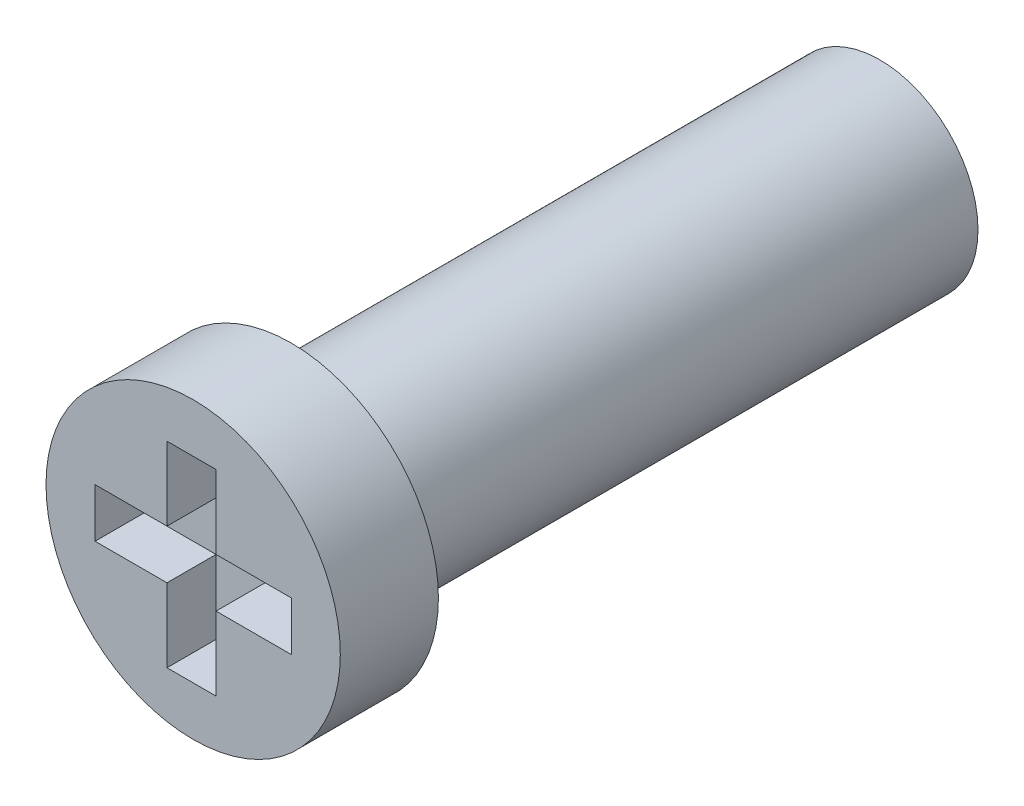
ISO-10303-21;
HEADER;
FILE_DESCRIPTION(('STEP AP214'),'2;1');
FILE_NAME('part.step','',(''),(''),'','','');
FILE_SCHEMA(('AUTOMOTIVE_DESIGN { 1 0 10303 214 1 1 1 1 }'));
ENDSEC;
DATA;
#1=APPLICATION_CONTEXT('core data for automotive mechanical design processes');
#2=APPLICATION_PROTOCOL_DEFINITION('international standard','automotive_design',2000,#1);
#3=PRODUCT_CONTEXT('',#1,'mechanical');
#4=PRODUCT('Part','Part','',(#3));
#5=PRODUCT_RELATED_PRODUCT_CATEGORY('part','',(#4));
#6=PRODUCT_DEFINITION_FORMATION('','',#4);
#7=PRODUCT_DEFINITION_CONTEXT('part definition',#1,'design');
#8=PRODUCT_DEFINITION('design','',#6,#7);
#9=PRODUCT_DEFINITION_SHAPE('','',#8);
#10=(LENGTH_UNIT() NAMED_UNIT(*) SI_UNIT(.MILLI.,.METRE.));
#11=(NAMED_UNIT(*) PLANE_ANGLE_UNIT() SI_UNIT($,.RADIAN.));
#12=(NAMED_UNIT(*) SI_UNIT($,.STERADIAN.) SOLID_ANGLE_UNIT());
#13=UNCERTAINTY_MEASURE_WITH_UNIT(LENGTH_MEASURE(1.E-05),#10,'distance_accuracy_value','');
#14=(GEOMETRIC_REPRESENTATION_CONTEXT(3) GLOBAL_UNCERTAINTY_ASSIGNED_CONTEXT((#13)) GLOBAL_UNIT_ASSIGNED_CONTEXT((#10,
#11,#12)) REPRESENTATION_CONTEXT('',''));
#15=CARTESIAN_POINT('',(0.,0.,0.));
#16=DIRECTION('',(0.,0.,1.));
#17=DIRECTION('',(1.,0.,0.));
#18=AXIS2_PLACEMENT_3D('',#15,#16,#17);
#19=CARTESIAN_POINT('',(0.,0.,12.));
#20=DIRECTION('',(0.,0.,-1.));
#21=DIRECTION('',(-1.,0.,0.));
#22=AXIS2_PLACEMENT_3D('',#19,#20,#21);
#23=CYLINDRICAL_SURFACE('',#22,2.);
#24=CARTESIAN_POINT('',(0.,0.,12.));
#25=DIRECTION('',(0.,0.,1.));
#26=DIRECTION('',(1.,0.,0.));
#27=AXIS2_PLACEMENT_3D('',#24,#25,#26);
#28=CIRCLE('',#27,2.);
#29=CARTESIAN_POINT('',(2.,0.,12.));
#30=VERTEX_POINT('',#29);
#31=EDGE_CURVE('E11',#30,#30,#28,.T.);
#32=ORIENTED_EDGE('',*,*,#31,.F.);
#33=EDGE_LOOP('',(#32));
#34=FACE_BOUND('',#33,.T.);
#35=CARTESIAN_POINT('',(0.,0.,0.));
#36=DIRECTION('',(0.,0.,1.));
#37=DIRECTION('',(1.,0.,0.));
#38=AXIS2_PLACEMENT_3D('',#35,#36,#37);
#39=CIRCLE('',#38,2.);
#40=CARTESIAN_POINT('',(2.,0.,0.));
#41=VERTEX_POINT('',#40);
#42=EDGE_CURVE('E39',#41,#41,#39,.T.);
#43=ORIENTED_EDGE('',*,*,#42,.T.);
#44=EDGE_LOOP('',(#43));
#45=FACE_BOUND('',#44,.T.);
#46=ADVANCED_FACE('F36',(#34,#45),#23,.T.);
#47=CARTESIAN_POINT('',(0.,0.,0.));
#48=DIRECTION('',(0.,0.,1.));
#49=DIRECTION('',(1.,0.,0.));
#50=AXIS2_PLACEMENT_3D('',#47,#48,#49);
#51=PLANE('',#50);
#52=ORIENTED_EDGE('',*,*,#42,.F.);
#53=EDGE_LOOP('',(#52));
#54=FACE_BOUND('',#53,.T.);
#55=ADVANCED_FACE('F233',(#54),#51,.F.);
#56=CARTESIAN_POINT('',(0.,0.,14.));
#57=DIRECTION('',(0.,0.,-1.));
#58=DIRECTION('',(-1.,0.,0.));
#59=AXIS2_PLACEMENT_3D('',#56,#57,#58);
#60=CYLINDRICAL_SURFACE('',#59,3.);
#61=CARTESIAN_POINT('',(0.,0.,14.));
#62=DIRECTION('',(0.,0.,1.));
#63=DIRECTION('',(1.,0.,0.));
#64=AXIS2_PLACEMENT_3D('',#61,#62,#63);
#65=CIRCLE('',#64,3.);
#66=CARTESIAN_POINT('',(3.,0.,14.));
#67=VERTEX_POINT('',#66);
#68=EDGE_CURVE('E209',#67,#67,#65,.T.);
#69=ORIENTED_EDGE('',*,*,#68,.F.);
#70=EDGE_LOOP('',(#69));
#71=FACE_BOUND('',#70,.T.);
#72=CARTESIAN_POINT('',(0.,0.,12.));
#73=DIRECTION('',(0.,0.,1.));
#74=DIRECTION('',(1.,0.,0.));
#75=AXIS2_PLACEMENT_3D('',#72,#73,#74);
#76=CIRCLE('',#75,3.);
#77=CARTESIAN_POINT('',(3.,0.,12.));
#78=VERTEX_POINT('',#77);
#79=EDGE_CURVE('E191',#78,#78,#76,.T.);
#80=ORIENTED_EDGE('',*,*,#79,.T.);
#81=EDGE_LOOP('',(#80));
#82=FACE_BOUND('',#81,.T.);
#83=ADVANCED_FACE('F215',(#71,#82),#60,.T.);
#84=CARTESIAN_POINT('',(0.,0.,14.));
#85=DIRECTION('',(0.,0.,1.));
#86=DIRECTION('',(1.,0.,0.));
#87=AXIS2_PLACEMENT_3D('',#84,#85,#86);
#88=PLANE('',#87);
#89=DIRECTION('',(0.,-1.,0.));
#90=VECTOR('',#89,1.);
#91=CARTESIAN_POINT('',(-0.533471751105531,2.,14.));
#92=LINE('',#91,#90);
#93=CARTESIAN_POINT('',(-0.533471751105531,2.,14.));
#94=VERTEX_POINT('',#93);
#95=CARTESIAN_POINT('',(-0.533471751105531,0.5,14.));
#96=VERTEX_POINT('',#95);
#97=EDGE_CURVE('E50',#94,#96,#92,.T.);
#98=ORIENTED_EDGE('',*,*,#97,.F.);
#99=DIRECTION('',(-1.,0.,0.));
#100=VECTOR('',#99,1.);
#101=CARTESIAN_POINT('',(-0.533471751105531,2.,14.));
#102=LINE('',#101,#100);
#103=CARTESIAN_POINT('',(0.466528248894469,2.,14.));
#104=VERTEX_POINT('',#103);
#105=EDGE_CURVE('E187',#104,#94,#102,.T.);
#106=ORIENTED_EDGE('',*,*,#105,.F.);
#107=DIRECTION('',(0.,1.,0.));
#108=VECTOR('',#107,1.);
#109=CARTESIAN_POINT('',(0.466528248894469,2.,14.));
#110=LINE('',#109,#108);
#111=CARTESIAN_POINT('',(0.466528248894469,0.5,14.));
#112=VERTEX_POINT('',#111);
#113=EDGE_CURVE('E185',#112,#104,#110,.T.);
#114=ORIENTED_EDGE('',*,*,#113,.F.);
#115=DIRECTION('',(-1.,0.,0.));
#116=VECTOR('',#115,1.);
#117=CARTESIAN_POINT('',(0.466528248894469,0.5,14.));
#118=LINE('',#117,#116);
#119=CARTESIAN_POINT('',(2.,0.5,14.));
#120=VERTEX_POINT('',#119);
#121=EDGE_CURVE('E134',#120,#112,#118,.T.);
#122=ORIENTED_EDGE('',*,*,#121,.F.);
#123=DIRECTION('',(0.,1.,0.));
#124=VECTOR('',#123,1.);
#125=CARTESIAN_POINT('',(2.,-0.5,14.));
#126=LINE('',#125,#124);
#127=CARTESIAN_POINT('',(2.,-0.5,14.));
#128=VERTEX_POINT('',#127);
#129=EDGE_CURVE('E181',#128,#120,#126,.T.);
#130=ORIENTED_EDGE('',*,*,#129,.F.);
#131=DIRECTION('',(1.,0.,0.));
#132=VECTOR('',#131,1.);
#133=CARTESIAN_POINT('',(0.466528248894469,-0.5,14.));
#134=LINE('',#133,#132);
#135=CARTESIAN_POINT('',(0.466528248894469,-0.5,14.));
#136=VERTEX_POINT('',#135);
#137=EDGE_CURVE('E178',#136,#128,#134,.T.);
#138=ORIENTED_EDGE('',*,*,#137,.F.);
#139=DIRECTION('',(0.,1.,0.));
#140=VECTOR('',#139,1.);
#141=CARTESIAN_POINT('',(0.466528248894469,-0.5,14.));
#142=LINE('',#141,#140);
#143=CARTESIAN_POINT('',(0.466528248894469,-2.,14.));
#144=VERTEX_POINT('',#143);
#145=EDGE_CURVE('E175',#144,#136,#142,.T.);
#146=ORIENTED_EDGE('',*,*,#145,.F.);
#147=DIRECTION('',(1.,0.,0.));
#148=VECTOR('',#147,1.);
#149=CARTESIAN_POINT('',(-0.533471751105531,-2.,14.));
#150=LINE('',#149,#148);
#151=CARTESIAN_POINT('',(-0.533471751105531,-2.,14.));
#152=VERTEX_POINT('',#151);
#153=EDGE_CURVE('E172',#152,#144,#150,.T.);
#154=ORIENTED_EDGE('',*,*,#153,.F.);
#155=DIRECTION('',(0.,-1.,0.));
#156=VECTOR('',#155,1.);
#157=CARTESIAN_POINT('',(-0.533471751105531,-0.5,14.));
#158=LINE('',#157,#156);
#159=CARTESIAN_POINT('',(-0.533471751105531,-0.5,14.));
#160=VERTEX_POINT('',#159);
#161=EDGE_CURVE('E169',#160,#152,#158,.T.);
#162=ORIENTED_EDGE('',*,*,#161,.F.);
#163=DIRECTION('',(1.,0.,0.));
#164=VECTOR('',#163,1.);
#165=CARTESIAN_POINT('',(-2.,-0.5,14.));
#166=LINE('',#165,#164);
#167=CARTESIAN_POINT('',(-2.,-0.5,14.));
#168=VERTEX_POINT('',#167);
#169=EDGE_CURVE('E166',#168,#160,#166,.T.);
#170=ORIENTED_EDGE('',*,*,#169,.F.);
#171=DIRECTION('',(0.,-1.,0.));
#172=VECTOR('',#171,1.);
#173=CARTESIAN_POINT('',(-2.,-0.5,14.));
#174=LINE('',#173,#172);
#175=CARTESIAN_POINT('',(-2.,0.5,14.));
#176=VERTEX_POINT('',#175);
#177=EDGE_CURVE('E163',#176,#168,#174,.T.);
#178=ORIENTED_EDGE('',*,*,#177,.F.);
#179=DIRECTION('',(-1.,0.,0.));
#180=VECTOR('',#179,1.);
#181=CARTESIAN_POINT('',(-2.,0.5,14.));
#182=LINE('',#181,#180);
#183=EDGE_CURVE('E160',#96,#176,#182,.T.);
#184=ORIENTED_EDGE('',*,*,#183,.F.);
#185=EDGE_LOOP('',(#98,#106,#114,#122,#130,#138,#146,#154,#162,#170,#178,#184));
#186=FACE_BOUND('',#185,.T.);
#187=ORIENTED_EDGE('',*,*,#68,.T.);
#188=EDGE_LOOP('',(#187));
#189=FACE_BOUND('',#188,.T.);
#190=ADVANCED_FACE('F220',(#186,#189),#88,.T.);
#191=CARTESIAN_POINT('',(0.,0.,12.));
#192=DIRECTION('',(0.,0.,1.));
#193=DIRECTION('',(1.,0.,0.));
#194=AXIS2_PLACEMENT_3D('',#191,#192,#193);
#195=PLANE('',#194);
#196=ORIENTED_EDGE('',*,*,#31,.T.);
#197=EDGE_LOOP('',(#196));
#198=FACE_BOUND('',#197,.T.);
#199=ORIENTED_EDGE('',*,*,#79,.F.);
#200=EDGE_LOOP('',(#199));
#201=FACE_BOUND('',#200,.T.);
#202=ADVANCED_FACE('F217',(#198,#201),#195,.F.);
#203=CARTESIAN_POINT('',(-0.533471751105531,2.,13.));
#204=DIRECTION('',(-1.,0.,0.));
#205=DIRECTION('',(0.,-1.,0.));
#206=AXIS2_PLACEMENT_3D('',#203,#204,#205);
#207=PLANE('',#206);
#208=ORIENTED_EDGE('',*,*,#97,.T.);
#209=DIRECTION('',(0.,0.,1.));
#210=VECTOR('',#209,1.);
#211=CARTESIAN_POINT('',(-0.533471751105531,0.5,13.));
#212=LINE('',#211,#210);
#213=CARTESIAN_POINT('',(-0.533471751105531,0.5,13.));
#214=VERTEX_POINT('',#213);
#215=EDGE_CURVE('E98',#214,#96,#212,.T.);
#216=ORIENTED_EDGE('',*,*,#215,.F.);
#217=DIRECTION('',(0.,-1.,0.));
#218=VECTOR('',#217,1.);
#219=CARTESIAN_POINT('',(-0.533471751105531,2.,13.));
#220=LINE('',#219,#218);
#221=CARTESIAN_POINT('',(-0.533471751105531,2.,13.));
#222=VERTEX_POINT('',#221);
#223=EDGE_CURVE('E189',#222,#214,#220,.T.);
#224=ORIENTED_EDGE('',*,*,#223,.F.);
#225=DIRECTION('',(0.,0.,1.));
#226=VECTOR('',#225,1.);
#227=CARTESIAN_POINT('',(-0.533471751105531,2.,13.));
#228=LINE('',#227,#226);
#229=EDGE_CURVE('E58',#222,#94,#228,.T.);
#230=ORIENTED_EDGE('',*,*,#229,.T.);
#231=EDGE_LOOP('',(#208,#216,#224,#230));
#232=FACE_BOUND('',#231,.T.);
#233=ADVANCED_FACE('F219',(#232),#207,.F.);
#234=CARTESIAN_POINT('',(-0.533471751105531,2.,13.));
#235=DIRECTION('',(0.,1.,0.));
#236=DIRECTION('',(0.,0.,1.));
#237=AXIS2_PLACEMENT_3D('',#234,#235,#236);
#238=PLANE('',#237);
#239=ORIENTED_EDGE('',*,*,#105,.T.);
#240=ORIENTED_EDGE('',*,*,#229,.F.);
#241=DIRECTION('',(-1.,0.,0.));
#242=VECTOR('',#241,1.);
#243=CARTESIAN_POINT('',(-0.533471751105531,2.,13.));
#244=LINE('',#243,#242);
#245=CARTESIAN_POINT('',(0.466528248894469,2.,13.));
#246=VERTEX_POINT('',#245);
#247=EDGE_CURVE('E146',#246,#222,#244,.T.);
#248=ORIENTED_EDGE('',*,*,#247,.F.);
#249=DIRECTION('',(0.,0.,1.));
#250=VECTOR('',#249,1.);
#251=CARTESIAN_POINT('',(0.466528248894469,2.,13.));
#252=LINE('',#251,#250);
#253=EDGE_CURVE('E138',#246,#104,#252,.T.);
#254=ORIENTED_EDGE('',*,*,#253,.T.);
#255=EDGE_LOOP('',(#239,#240,#248,#254));
#256=FACE_BOUND('',#255,.T.);
#257=ADVANCED_FACE('F227',(#256),#238,.F.);
#258=CARTESIAN_POINT('',(0.466528248894469,2.,13.));
#259=DIRECTION('',(1.,0.,0.));
#260=DIRECTION('',(0.,1.,0.));
#261=AXIS2_PLACEMENT_3D('',#258,#259,#260);
#262=PLANE('',#261);
#263=ORIENTED_EDGE('',*,*,#113,.T.);
#264=ORIENTED_EDGE('',*,*,#253,.F.);
#265=DIRECTION('',(0.,1.,0.));
#266=VECTOR('',#265,1.);
#267=CARTESIAN_POINT('',(0.466528248894469,2.,13.));
#268=LINE('',#267,#266);
#269=CARTESIAN_POINT('',(0.466528248894469,0.5,13.));
#270=VERTEX_POINT('',#269);
#271=EDGE_CURVE('E142',#270,#246,#268,.T.);
#272=ORIENTED_EDGE('',*,*,#271,.F.);
#273=DIRECTION('',(0.,0.,1.));
#274=VECTOR('',#273,1.);
#275=CARTESIAN_POINT('',(0.466528248894469,0.5,13.));
#276=LINE('',#275,#274);
#277=EDGE_CURVE('E127',#270,#112,#276,.T.);
#278=ORIENTED_EDGE('',*,*,#277,.T.);
#279=EDGE_LOOP('',(#263,#264,#272,#278));
#280=FACE_BOUND('',#279,.T.);
#281=ADVANCED_FACE('F143',(#280),#262,.F.);
#282=CARTESIAN_POINT('',(0.466528248894469,0.5,13.));
#283=DIRECTION('',(0.,1.,0.));
#284=DIRECTION('',(-1.,0.,0.));
#285=AXIS2_PLACEMENT_3D('',#282,#283,#284);
#286=PLANE('',#285);
#287=ORIENTED_EDGE('',*,*,#121,.T.);
#288=ORIENTED_EDGE('',*,*,#277,.F.);
#289=DIRECTION('',(-1.,0.,0.));
#290=VECTOR('',#289,1.);
#291=CARTESIAN_POINT('',(0.466528248894469,0.5,13.));
#292=LINE('',#291,#290);
#293=CARTESIAN_POINT('',(2.,0.5,13.));
#294=VERTEX_POINT('',#293);
#295=EDGE_CURVE('E131',#294,#270,#292,.T.);
#296=ORIENTED_EDGE('',*,*,#295,.F.);
#297=DIRECTION('',(0.,0.,1.));
#298=VECTOR('',#297,1.);
#299=CARTESIAN_POINT('',(2.,0.5,13.));
#300=LINE('',#299,#298);
#301=EDGE_CURVE('E139',#294,#120,#300,.T.);
#302=ORIENTED_EDGE('',*,*,#301,.T.);
#303=EDGE_LOOP('',(#287,#288,#296,#302));
#304=FACE_BOUND('',#303,.T.);
#305=ADVANCED_FACE('F129',(#304),#286,.F.);
#306=CARTESIAN_POINT('',(2.,-0.5,13.));
#307=DIRECTION('',(1.,0.,0.));
#308=DIRECTION('',(0.,0.,-1.));
#309=AXIS2_PLACEMENT_3D('',#306,#307,#308);
#310=PLANE('',#309);
#311=ORIENTED_EDGE('',*,*,#129,.T.);
#312=ORIENTED_EDGE('',*,*,#301,.F.);
#313=DIRECTION('',(0.,1.,0.));
#314=VECTOR('',#313,1.);
#315=CARTESIAN_POINT('',(2.,-0.5,13.));
#316=LINE('',#315,#314);
#317=CARTESIAN_POINT('',(2.,-0.5,13.));
#318=VERTEX_POINT('',#317);
#319=EDGE_CURVE('E152',#318,#294,#316,.T.);
#320=ORIENTED_EDGE('',*,*,#319,.F.);
#321=DIRECTION('',(0.,0.,1.));
#322=VECTOR('',#321,1.);
#323=CARTESIAN_POINT('',(2.,-0.5,13.));
#324=LINE('',#323,#322);
#325=EDGE_CURVE('E194',#318,#128,#324,.T.);
#326=ORIENTED_EDGE('',*,*,#325,.T.);
#327=EDGE_LOOP('',(#311,#312,#320,#326));
#328=FACE_BOUND('',#327,.T.);
#329=ADVANCED_FACE('F288',(#328),#310,.F.);
#330=CARTESIAN_POINT('',(0.466528248894469,-0.5,13.));
#331=DIRECTION('',(0.,-1.,0.));
#332=DIRECTION('',(0.,0.,-1.));
#333=AXIS2_PLACEMENT_3D('',#330,#331,#332);
#334=PLANE('',#333);
#335=ORIENTED_EDGE('',*,*,#137,.T.);
#336=ORIENTED_EDGE('',*,*,#325,.F.);
#337=DIRECTION('',(1.,0.,0.));
#338=VECTOR('',#337,1.);
#339=CARTESIAN_POINT('',(0.466528248894469,-0.5,13.));
#340=LINE('',#339,#338);
#341=CARTESIAN_POINT('',(0.466528248894469,-0.5,13.));
#342=VERTEX_POINT('',#341);
#343=EDGE_CURVE('E154',#342,#318,#340,.T.);
#344=ORIENTED_EDGE('',*,*,#343,.F.);
#345=DIRECTION('',(0.,0.,1.));
#346=VECTOR('',#345,1.);
#347=CARTESIAN_POINT('',(0.466528248894469,-0.5,13.));
#348=LINE('',#347,#346);
#349=EDGE_CURVE('E196',#342,#136,#348,.T.);
#350=ORIENTED_EDGE('',*,*,#349,.T.);
#351=EDGE_LOOP('',(#335,#336,#344,#350));
#352=FACE_BOUND('',#351,.T.);
#353=ADVANCED_FACE('F297',(#352),#334,.F.);
#354=CARTESIAN_POINT('',(0.466528248894469,-0.5,13.));
#355=DIRECTION('',(1.,0.,0.));
#356=DIRECTION('',(0.,1.,0.));
#357=AXIS2_PLACEMENT_3D('',#354,#355,#356);
#358=PLANE('',#357);
#359=ORIENTED_EDGE('',*,*,#145,.T.);
#360=ORIENTED_EDGE('',*,*,#349,.F.);
#361=DIRECTION('',(0.,1.,0.));
#362=VECTOR('',#361,1.);
#363=CARTESIAN_POINT('',(0.466528248894469,-0.5,13.));
#364=LINE('',#363,#362);
#365=CARTESIAN_POINT('',(0.466528248894469,-2.,13.));
#366=VERTEX_POINT('',#365);
#367=EDGE_CURVE('E402',#366,#342,#364,.T.);
#368=ORIENTED_EDGE('',*,*,#367,.F.);
#369=DIRECTION('',(0.,0.,1.));
#370=VECTOR('',#369,1.);
#371=CARTESIAN_POINT('',(0.466528248894469,-2.,13.));
#372=LINE('',#371,#370);
#373=EDGE_CURVE('E198',#366,#144,#372,.T.);
#374=ORIENTED_EDGE('',*,*,#373,.T.);
#375=EDGE_LOOP('',(#359,#360,#368,#374));
#376=FACE_BOUND('',#375,.T.);
#377=ADVANCED_FACE('F307',(#376),#358,.F.);
#378=CARTESIAN_POINT('',(-0.533471751105531,-2.,13.));
#379=DIRECTION('',(0.,-1.,0.));
#380=DIRECTION('',(0.,0.,-1.));
#381=AXIS2_PLACEMENT_3D('',#378,#379,#380);
#382=PLANE('',#381);
#383=ORIENTED_EDGE('',*,*,#153,.T.);
#384=ORIENTED_EDGE('',*,*,#373,.F.);
#385=DIRECTION('',(1.,0.,0.));
#386=VECTOR('',#385,1.);
#387=CARTESIAN_POINT('',(-0.533471751105531,-2.,13.));
#388=LINE('',#387,#386);
#389=CARTESIAN_POINT('',(-0.533471751105531,-2.,13.));
#390=VERTEX_POINT('',#389);
#391=EDGE_CURVE('E399',#390,#366,#388,.T.);
#392=ORIENTED_EDGE('',*,*,#391,.F.);
#393=DIRECTION('',(0.,0.,1.));
#394=VECTOR('',#393,1.);
#395=CARTESIAN_POINT('',(-0.533471751105531,-2.,13.));
#396=LINE('',#395,#394);
#397=EDGE_CURVE('E200',#390,#152,#396,.T.);
#398=ORIENTED_EDGE('',*,*,#397,.T.);
#399=EDGE_LOOP('',(#383,#384,#392,#398));
#400=FACE_BOUND('',#399,.T.);
#401=ADVANCED_FACE('F317',(#400),#382,.F.);
#402=CARTESIAN_POINT('',(-0.533471751105531,-0.5,13.));
#403=DIRECTION('',(-1.,0.,0.));
#404=DIRECTION('',(0.,-1.,0.));
#405=AXIS2_PLACEMENT_3D('',#402,#403,#404);
#406=PLANE('',#405);
#407=ORIENTED_EDGE('',*,*,#161,.T.);
#408=ORIENTED_EDGE('',*,*,#397,.F.);
#409=DIRECTION('',(0.,-1.,0.));
#410=VECTOR('',#409,1.);
#411=CARTESIAN_POINT('',(-0.533471751105531,-0.5,13.));
#412=LINE('',#411,#410);
#413=CARTESIAN_POINT('',(-0.533471751105531,-0.5,13.));
#414=VERTEX_POINT('',#413);
#415=EDGE_CURVE('E396',#414,#390,#412,.T.);
#416=ORIENTED_EDGE('',*,*,#415,.F.);
#417=DIRECTION('',(0.,0.,1.));
#418=VECTOR('',#417,1.);
#419=CARTESIAN_POINT('',(-0.533471751105531,-0.5,13.));
#420=LINE('',#419,#418);
#421=EDGE_CURVE('E202',#414,#160,#420,.T.);
#422=ORIENTED_EDGE('',*,*,#421,.T.);
#423=EDGE_LOOP('',(#407,#408,#416,#422));
#424=FACE_BOUND('',#423,.T.);
#425=ADVANCED_FACE('F327',(#424),#406,.F.);
#426=CARTESIAN_POINT('',(-2.,-0.5,13.));
#427=DIRECTION('',(0.,-1.,0.));
#428=DIRECTION('',(0.,0.,-1.));
#429=AXIS2_PLACEMENT_3D('',#426,#427,#428);
#430=PLANE('',#429);
#431=ORIENTED_EDGE('',*,*,#169,.T.);
#432=ORIENTED_EDGE('',*,*,#421,.F.);
#433=DIRECTION('',(1.,0.,0.));
#434=VECTOR('',#433,1.);
#435=CARTESIAN_POINT('',(-2.,-0.5,13.));
#436=LINE('',#435,#434);
#437=CARTESIAN_POINT('',(-2.,-0.5,13.));
#438=VERTEX_POINT('',#437);
#439=EDGE_CURVE('E389',#438,#414,#436,.T.);
#440=ORIENTED_EDGE('',*,*,#439,.F.);
#441=DIRECTION('',(0.,0.,1.));
#442=VECTOR('',#441,1.);
#443=CARTESIAN_POINT('',(-2.,-0.5,13.));
#444=LINE('',#443,#442);
#445=EDGE_CURVE('E204',#438,#168,#444,.T.);
#446=ORIENTED_EDGE('',*,*,#445,.T.);
#447=EDGE_LOOP('',(#431,#432,#440,#446));
#448=FACE_BOUND('',#447,.T.);
#449=ADVANCED_FACE('F337',(#448),#430,.F.);
#450=CARTESIAN_POINT('',(-2.,-0.5,13.));
#451=DIRECTION('',(-1.,0.,0.));
#452=DIRECTION('',(0.,0.,1.));
#453=AXIS2_PLACEMENT_3D('',#450,#451,#452);
#454=PLANE('',#453);
#455=ORIENTED_EDGE('',*,*,#177,.T.);
#456=ORIENTED_EDGE('',*,*,#445,.F.);
#457=DIRECTION('',(0.,-1.,0.));
#458=VECTOR('',#457,1.);
#459=CARTESIAN_POINT('',(-2.,-0.5,13.));
#460=LINE('',#459,#458);
#461=CARTESIAN_POINT('',(-2.,0.5,13.));
#462=VERTEX_POINT('',#461);
#463=EDGE_CURVE('E386',#462,#438,#460,.T.);
#464=ORIENTED_EDGE('',*,*,#463,.F.);
#465=DIRECTION('',(0.,0.,1.));
#466=VECTOR('',#465,1.);
#467=CARTESIAN_POINT('',(-2.,0.5,13.));
#468=LINE('',#467,#466);
#469=EDGE_CURVE('E206',#462,#176,#468,.T.);
#470=ORIENTED_EDGE('',*,*,#469,.T.);
#471=EDGE_LOOP('',(#455,#456,#464,#470));
#472=FACE_BOUND('',#471,.T.);
#473=ADVANCED_FACE('F347',(#472),#454,.F.);
#474=CARTESIAN_POINT('',(-2.,0.5,13.));
#475=DIRECTION('',(0.,1.,0.));
#476=DIRECTION('',(-1.,0.,0.));
#477=AXIS2_PLACEMENT_3D('',#474,#475,#476);
#478=PLANE('',#477);
#479=ORIENTED_EDGE('',*,*,#183,.T.);
#480=ORIENTED_EDGE('',*,*,#469,.F.);
#481=DIRECTION('',(-1.,0.,0.));
#482=VECTOR('',#481,1.);
#483=CARTESIAN_POINT('',(-2.,0.5,13.));
#484=LINE('',#483,#482);
#485=EDGE_CURVE('E390',#214,#462,#484,.T.);
#486=ORIENTED_EDGE('',*,*,#485,.F.);
#487=ORIENTED_EDGE('',*,*,#215,.T.);
#488=EDGE_LOOP('',(#479,#480,#486,#487));
#489=FACE_BOUND('',#488,.T.);
#490=ADVANCED_FACE('F357',(#489),#478,.F.);
#491=CARTESIAN_POINT('',(0.,0.,13.));
#492=DIRECTION('',(0.,0.,1.));
#493=DIRECTION('',(1.,0.,0.));
#494=AXIS2_PLACEMENT_3D('',#491,#492,#493);
#495=PLANE('',#494);
#496=ORIENTED_EDGE('',*,*,#223,.T.);
#497=ORIENTED_EDGE('',*,*,#485,.T.);
#498=ORIENTED_EDGE('',*,*,#463,.T.);
#499=ORIENTED_EDGE('',*,*,#439,.T.);
#500=ORIENTED_EDGE('',*,*,#415,.T.);
#501=ORIENTED_EDGE('',*,*,#391,.T.);
#502=ORIENTED_EDGE('',*,*,#367,.T.);
#503=ORIENTED_EDGE('',*,*,#343,.T.);
#504=ORIENTED_EDGE('',*,*,#319,.T.);
#505=ORIENTED_EDGE('',*,*,#295,.T.);
#506=ORIENTED_EDGE('',*,*,#271,.T.);
#507=ORIENTED_EDGE('',*,*,#247,.T.);
#508=EDGE_LOOP('',(#496,#497,#498,#499,#500,#501,#502,#503,#504,#505,#506,#507));
#509=FACE_BOUND('',#508,.T.);
#510=ADVANCED_FACE('F149',(#509),#495,.T.);
#511=CLOSED_SHELL('',(#46,#55,#83,#190,#202,#233,#257,#281,#305,#329,#353,#377,#401,#425,#449,
#473,#490,#510));
#512=MANIFOLD_SOLID_BREP('B2',#511);
#513=ADVANCED_BREP_SHAPE_REPRESENTATION('',(#18,#512),#14);
#514=SHAPE_DEFINITION_REPRESENTATION(#9,#513);
ENDSEC;
END-ISO-10303-21;
